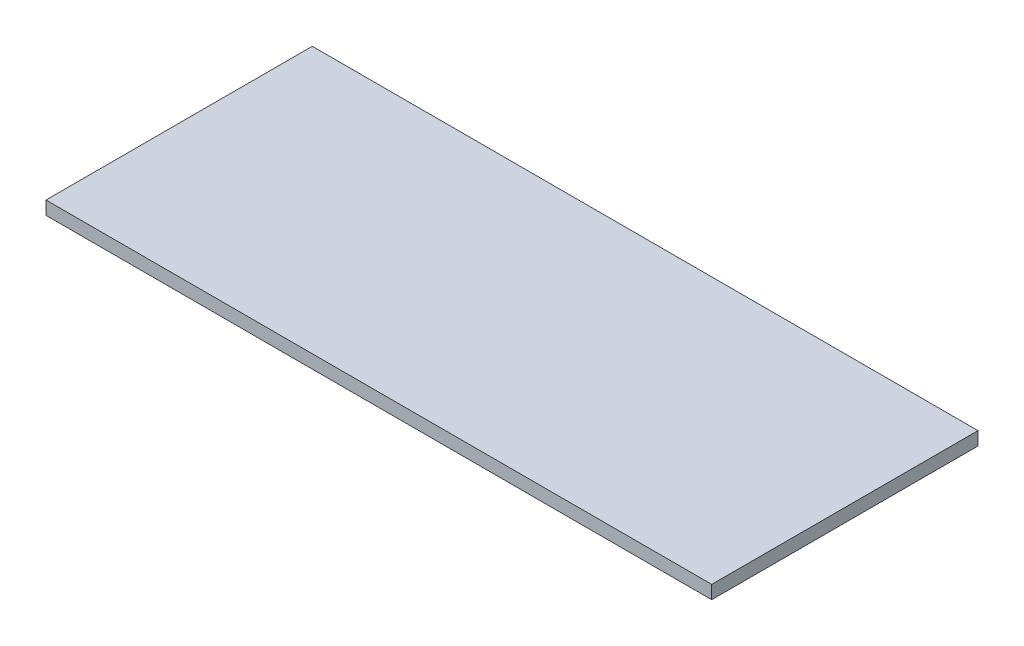
ISO-10303-21;
HEADER;
FILE_DESCRIPTION(('STEP AP214'),'2;1');
FILE_NAME('part.step','',(''),(''),'','','');
FILE_SCHEMA(('AUTOMOTIVE_DESIGN { 1 0 10303 214 1 1 1 1 }'));
ENDSEC;
DATA;
#1=APPLICATION_CONTEXT('core data for automotive mechanical design processes');
#2=APPLICATION_PROTOCOL_DEFINITION('international standard','automotive_design',2000,#1);
#3=PRODUCT_CONTEXT('',#1,'mechanical');
#4=PRODUCT('Part','Part','',(#3));
#5=PRODUCT_RELATED_PRODUCT_CATEGORY('part','',(#4));
#6=PRODUCT_DEFINITION_FORMATION('','',#4);
#7=PRODUCT_DEFINITION_CONTEXT('part definition',#1,'design');
#8=PRODUCT_DEFINITION('design','',#6,#7);
#9=PRODUCT_DEFINITION_SHAPE('','',#8);
#10=(LENGTH_UNIT() NAMED_UNIT(*) SI_UNIT(.MILLI.,.METRE.));
#11=(NAMED_UNIT(*) PLANE_ANGLE_UNIT() SI_UNIT($,.RADIAN.));
#12=(NAMED_UNIT(*) SI_UNIT($,.STERADIAN.) SOLID_ANGLE_UNIT());
#13=UNCERTAINTY_MEASURE_WITH_UNIT(LENGTH_MEASURE(1.E-05),#10,'distance_accuracy_value','');
#14=(GEOMETRIC_REPRESENTATION_CONTEXT(3) GLOBAL_UNCERTAINTY_ASSIGNED_CONTEXT((#13)) GLOBAL_UNIT_ASSIGNED_CONTEXT((#10,
#11,#12)) REPRESENTATION_CONTEXT('',''));
#15=CARTESIAN_POINT('',(0.,0.,0.));
#16=DIRECTION('',(0.,0.,1.));
#17=DIRECTION('',(1.,0.,0.));
#18=AXIS2_PLACEMENT_3D('',#15,#16,#17);
#19=CARTESIAN_POINT('',(-750.,30.,545.527156549521));
#20=DIRECTION('',(0.,0.,-1.));
#21=DIRECTION('',(-1.,0.,0.));
#22=AXIS2_PLACEMENT_3D('',#19,#20,#21);
#23=PLANE('',#22);
#24=DIRECTION('',(1.,0.,0.));
#25=VECTOR('',#24,1.);
#26=CARTESIAN_POINT('',(-750.,0.,545.527156549521));
#27=LINE('',#26,#25);
#28=CARTESIAN_POINT('',(-750.,0.,545.527156549521));
#29=VERTEX_POINT('',#28);
#30=CARTESIAN_POINT('',(750.,0.,545.527156549521));
#31=VERTEX_POINT('',#30);
#32=EDGE_CURVE('E104',#29,#31,#27,.T.);
#33=ORIENTED_EDGE('',*,*,#32,.T.);
#34=DIRECTION('',(0.,-1.,0.));
#35=VECTOR('',#34,1.);
#36=CARTESIAN_POINT('',(750.,30.,545.527156549521));
#37=LINE('',#36,#35);
#38=CARTESIAN_POINT('',(750.,30.,545.527156549521));
#39=VERTEX_POINT('',#38);
#40=EDGE_CURVE('E11',#39,#31,#37,.T.);
#41=ORIENTED_EDGE('',*,*,#40,.F.);
#42=DIRECTION('',(1.,0.,0.));
#43=VECTOR('',#42,1.);
#44=CARTESIAN_POINT('',(-750.,30.,545.527156549521));
#45=LINE('',#44,#43);
#46=CARTESIAN_POINT('',(-750.,30.,545.527156549521));
#47=VERTEX_POINT('',#46);
#48=EDGE_CURVE('E92',#47,#39,#45,.T.);
#49=ORIENTED_EDGE('',*,*,#48,.F.);
#50=DIRECTION('',(0.,-1.,0.));
#51=VECTOR('',#50,1.);
#52=CARTESIAN_POINT('',(-750.,30.,545.527156549521));
#53=LINE('',#52,#51);
#54=EDGE_CURVE('E100',#47,#29,#53,.T.);
#55=ORIENTED_EDGE('',*,*,#54,.T.);
#56=EDGE_LOOP('',(#33,#41,#49,#55));
#57=FACE_BOUND('',#56,.T.);
#58=ADVANCED_FACE('F41',(#57),#23,.F.);
#59=CARTESIAN_POINT('',(750.,30.,545.527156549521));
#60=DIRECTION('',(-1.,0.,0.));
#61=DIRECTION('',(0.,0.,1.));
#62=AXIS2_PLACEMENT_3D('',#59,#60,#61);
#63=PLANE('',#62);
#64=DIRECTION('',(0.,0.,-1.));
#65=VECTOR('',#64,1.);
#66=CARTESIAN_POINT('',(750.,0.,545.527156549521));
#67=LINE('',#66,#65);
#68=CARTESIAN_POINT('',(750.,0.,-54.4728434504794));
#69=VERTEX_POINT('',#68);
#70=EDGE_CURVE('E96',#31,#69,#67,.T.);
#71=ORIENTED_EDGE('',*,*,#70,.T.);
#72=DIRECTION('',(0.,-1.,0.));
#73=VECTOR('',#72,1.);
#74=CARTESIAN_POINT('',(750.,30.,-54.4728434504794));
#75=LINE('',#74,#73);
#76=CARTESIAN_POINT('',(750.,30.,-54.4728434504794));
#77=VERTEX_POINT('',#76);
#78=EDGE_CURVE('E49',#77,#69,#75,.T.);
#79=ORIENTED_EDGE('',*,*,#78,.F.);
#80=DIRECTION('',(0.,0.,-1.));
#81=VECTOR('',#80,1.);
#82=CARTESIAN_POINT('',(750.,30.,545.527156549521));
#83=LINE('',#82,#81);
#84=EDGE_CURVE('E87',#39,#77,#83,.T.);
#85=ORIENTED_EDGE('',*,*,#84,.F.);
#86=ORIENTED_EDGE('',*,*,#40,.T.);
#87=EDGE_LOOP('',(#71,#79,#85,#86));
#88=FACE_BOUND('',#87,.T.);
#89=ADVANCED_FACE('F95',(#88),#63,.F.);
#90=CARTESIAN_POINT('',(-750.,30.,-54.4728434504794));
#91=DIRECTION('',(0.,0.,1.));
#92=DIRECTION('',(1.,0.,0.));
#93=AXIS2_PLACEMENT_3D('',#90,#91,#92);
#94=PLANE('',#93);
#95=DIRECTION('',(-1.,0.,0.));
#96=VECTOR('',#95,1.);
#97=CARTESIAN_POINT('',(-750.,0.,-54.4728434504794));
#98=LINE('',#97,#96);
#99=CARTESIAN_POINT('',(-750.,0.,-54.4728434504794));
#100=VERTEX_POINT('',#99);
#101=EDGE_CURVE('E74',#69,#100,#98,.T.);
#102=ORIENTED_EDGE('',*,*,#101,.T.);
#103=DIRECTION('',(0.,-1.,0.));
#104=VECTOR('',#103,1.);
#105=CARTESIAN_POINT('',(-750.,30.,-54.4728434504794));
#106=LINE('',#105,#104);
#107=CARTESIAN_POINT('',(-750.,30.,-54.4728434504794));
#108=VERTEX_POINT('',#107);
#109=EDGE_CURVE('E97',#108,#100,#106,.T.);
#110=ORIENTED_EDGE('',*,*,#109,.F.);
#111=DIRECTION('',(-1.,0.,0.));
#112=VECTOR('',#111,1.);
#113=CARTESIAN_POINT('',(-750.,30.,-54.4728434504794));
#114=LINE('',#113,#112);
#115=EDGE_CURVE('E90',#77,#108,#114,.T.);
#116=ORIENTED_EDGE('',*,*,#115,.F.);
#117=ORIENTED_EDGE('',*,*,#78,.T.);
#118=EDGE_LOOP('',(#102,#110,#116,#117));
#119=FACE_BOUND('',#118,.T.);
#120=ADVANCED_FACE('F98',(#119),#94,.F.);
#121=CARTESIAN_POINT('',(-750.,30.,-54.4728434504794));
#122=DIRECTION('',(1.,0.,0.));
#123=DIRECTION('',(0.,0.,-1.));
#124=AXIS2_PLACEMENT_3D('',#121,#122,#123);
#125=PLANE('',#124);
#126=DIRECTION('',(0.,0.,1.));
#127=VECTOR('',#126,1.);
#128=CARTESIAN_POINT('',(-750.,0.,-54.4728434504794));
#129=LINE('',#128,#127);
#130=EDGE_CURVE('E80',#100,#29,#129,.T.);
#131=ORIENTED_EDGE('',*,*,#130,.T.);
#132=ORIENTED_EDGE('',*,*,#54,.F.);
#133=DIRECTION('',(0.,0.,1.));
#134=VECTOR('',#133,1.);
#135=CARTESIAN_POINT('',(-750.,30.,-54.4728434504794));
#136=LINE('',#135,#134);
#137=EDGE_CURVE('E57',#108,#47,#136,.T.);
#138=ORIENTED_EDGE('',*,*,#137,.F.);
#139=ORIENTED_EDGE('',*,*,#109,.T.);
#140=EDGE_LOOP('',(#131,#132,#138,#139));
#141=FACE_BOUND('',#140,.T.);
#142=ADVANCED_FACE('F111',(#141),#125,.F.);
#143=CARTESIAN_POINT('',(0.,30.,0.));
#144=DIRECTION('',(0.,1.,0.));
#145=DIRECTION('',(0.,0.,1.));
#146=AXIS2_PLACEMENT_3D('',#143,#144,#145);
#147=PLANE('',#146);
#148=ORIENTED_EDGE('',*,*,#48,.T.);
#149=ORIENTED_EDGE('',*,*,#84,.T.);
#150=ORIENTED_EDGE('',*,*,#115,.T.);
#151=ORIENTED_EDGE('',*,*,#137,.T.);
#152=EDGE_LOOP('',(#148,#149,#150,#151));
#153=FACE_BOUND('',#152,.T.);
#154=ADVANCED_FACE('F88',(#153),#147,.T.);
#155=CARTESIAN_POINT('',(0.,0.,0.));
#156=DIRECTION('',(0.,1.,0.));
#157=DIRECTION('',(0.,0.,1.));
#158=AXIS2_PLACEMENT_3D('',#155,#156,#157);
#159=PLANE('',#158);
#160=ORIENTED_EDGE('',*,*,#32,.F.);
#161=ORIENTED_EDGE('',*,*,#130,.F.);
#162=ORIENTED_EDGE('',*,*,#101,.F.);
#163=ORIENTED_EDGE('',*,*,#70,.F.);
#164=EDGE_LOOP('',(#160,#161,#162,#163));
#165=FACE_BOUND('',#164,.T.);
#166=ADVANCED_FACE('F114',(#165),#159,.F.);
#167=CLOSED_SHELL('',(#58,#89,#120,#142,#154,#166));
#168=MANIFOLD_SOLID_BREP('B2',#167);
#169=ADVANCED_BREP_SHAPE_REPRESENTATION('',(#18,#168),#14);
#170=SHAPE_DEFINITION_REPRESENTATION(#9,#169);
ENDSEC;
END-ISO-10303-21;
